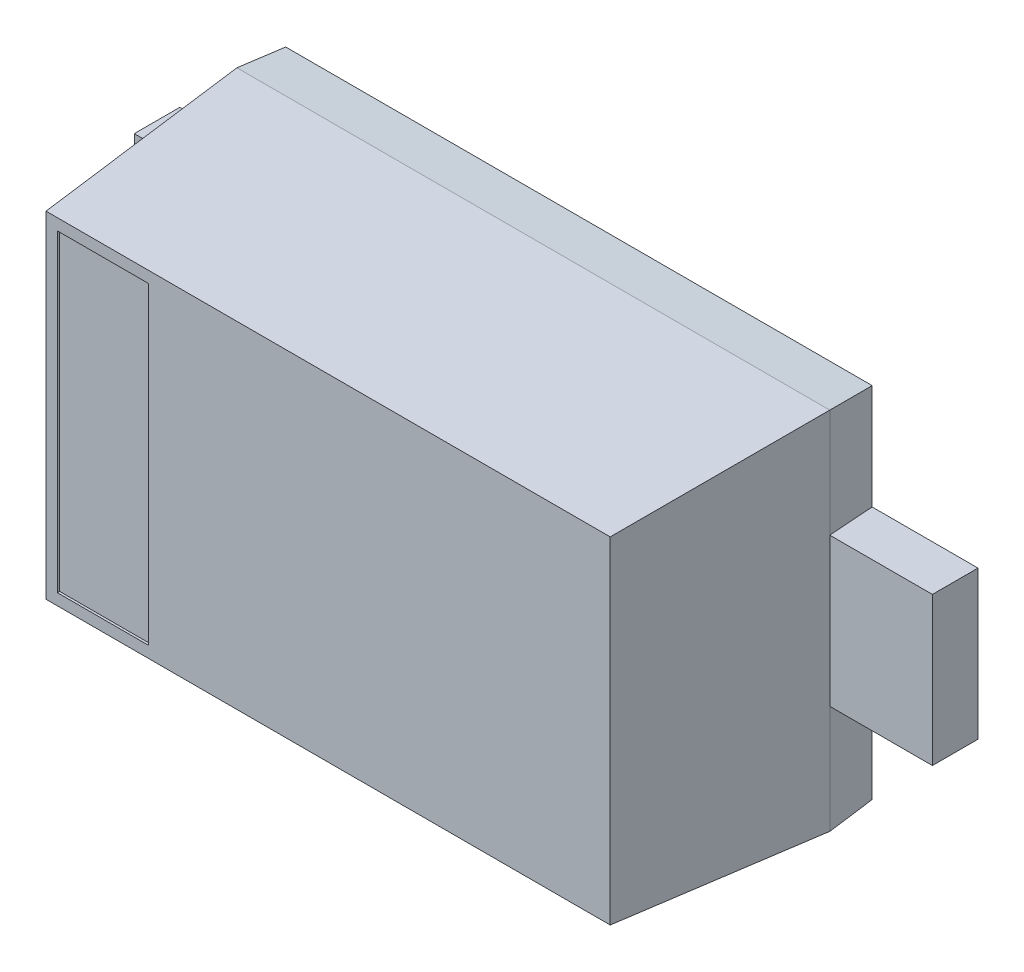
ISO-10303-21;
HEADER;
FILE_DESCRIPTION(('STEP AP214'),'2;1');
FILE_NAME('part.step','',(''),(''),'','','');
FILE_SCHEMA(('AUTOMOTIVE_DESIGN { 1 0 10303 214 1 1 1 1 }'));
ENDSEC;
DATA;
#1=APPLICATION_CONTEXT('core data for automotive mechanical design processes');
#2=APPLICATION_PROTOCOL_DEFINITION('international standard','automotive_design',2000,#1);
#3=PRODUCT_CONTEXT('',#1,'mechanical');
#4=PRODUCT('Part','Part','',(#3));
#5=PRODUCT_RELATED_PRODUCT_CATEGORY('part','',(#4));
#6=PRODUCT_DEFINITION_FORMATION('','',#4);
#7=PRODUCT_DEFINITION_CONTEXT('part definition',#1,'design');
#8=PRODUCT_DEFINITION('design','',#6,#7);
#9=PRODUCT_DEFINITION_SHAPE('','',#8);
#10=(LENGTH_UNIT() NAMED_UNIT(*) SI_UNIT(.MILLI.,.METRE.));
#11=(NAMED_UNIT(*) PLANE_ANGLE_UNIT() SI_UNIT($,.RADIAN.));
#12=(NAMED_UNIT(*) SI_UNIT($,.STERADIAN.) SOLID_ANGLE_UNIT());
#13=UNCERTAINTY_MEASURE_WITH_UNIT(LENGTH_MEASURE(1.E-05),#10,'distance_accuracy_value','');
#14=(GEOMETRIC_REPRESENTATION_CONTEXT(3) GLOBAL_UNCERTAINTY_ASSIGNED_CONTEXT((#13)) GLOBAL_UNIT_ASSIGNED_CONTEXT((#10,
#11,#12)) REPRESENTATION_CONTEXT('',''));
#15=CARTESIAN_POINT('',(0.,0.,0.));
#16=DIRECTION('',(0.,0.,1.));
#17=DIRECTION('',(1.,0.,0.));
#18=AXIS2_PLACEMENT_3D('',#15,#16,#17);
#19=CARTESIAN_POINT('',(1.75,-0.325,0.));
#20=DIRECTION('',(1.,0.,0.));
#21=DIRECTION('',(0.,0.,1.));
#22=AXIS2_PLACEMENT_3D('',#19,#20,#21);
#23=PLANE('',#22);
#24=DIRECTION('',(0.,0.,1.));
#25=VECTOR('',#24,1.);
#26=CARTESIAN_POINT('',(1.75,-0.325,0.));
#27=LINE('',#26,#25);
#28=CARTESIAN_POINT('',(1.75,-0.325,0.));
#29=VERTEX_POINT('',#28);
#30=CARTESIAN_POINT('',(1.75,-0.325,0.2));
#31=VERTEX_POINT('',#30);
#32=EDGE_CURVE('E11',#29,#31,#27,.T.);
#33=ORIENTED_EDGE('',*,*,#32,.F.);
#34=DIRECTION('',(0.,1.,0.));
#35=VECTOR('',#34,1.);
#36=CARTESIAN_POINT('',(1.75,-0.325,0.));
#37=LINE('',#36,#35);
#38=CARTESIAN_POINT('',(1.75,0.325,0.));
#39=VERTEX_POINT('',#38);
#40=EDGE_CURVE('E25',#29,#39,#37,.T.);
#41=ORIENTED_EDGE('',*,*,#40,.T.);
#42=DIRECTION('',(0.,0.,1.));
#43=VECTOR('',#42,1.);
#44=CARTESIAN_POINT('',(1.75,0.325,0.));
#45=LINE('',#44,#43);
#46=CARTESIAN_POINT('',(1.75,0.325,0.2));
#47=VERTEX_POINT('',#46);
#48=EDGE_CURVE('E494',#39,#47,#45,.T.);
#49=ORIENTED_EDGE('',*,*,#48,.T.);
#50=DIRECTION('',(0.,1.,0.));
#51=VECTOR('',#50,1.);
#52=CARTESIAN_POINT('',(1.75,-0.325,0.2));
#53=LINE('',#52,#51);
#54=EDGE_CURVE('E489',#31,#47,#53,.T.);
#55=ORIENTED_EDGE('',*,*,#54,.F.);
#56=EDGE_LOOP('',(#33,#41,#49,#55));
#57=FACE_BOUND('',#56,.T.);
#58=ADVANCED_FACE('F17',(#57),#23,.T.);
#59=CARTESIAN_POINT('',(1.286014637611,-0.325,0.2));
#60=DIRECTION('',(0.,0.,1.));
#61=DIRECTION('',(1.,0.,0.));
#62=AXIS2_PLACEMENT_3D('',#59,#60,#61);
#63=PLANE('',#62);
#64=DIRECTION('',(0.,1.,0.));
#65=VECTOR('',#64,1.);
#66=CARTESIAN_POINT('',(1.3,-0.8,0.2));
#67=LINE('',#66,#65);
#68=CARTESIAN_POINT('',(1.3,-0.325,0.2));
#69=VERTEX_POINT('',#68);
#70=CARTESIAN_POINT('',(1.3,0.325,0.2));
#71=VERTEX_POINT('',#70);
#72=EDGE_CURVE('E485',#69,#71,#67,.T.);
#73=ORIENTED_EDGE('',*,*,#72,.F.);
#74=DIRECTION('',(1.,0.,0.));
#75=VECTOR('',#74,1.);
#76=CARTESIAN_POINT('',(1.286014637611,-0.325,0.2));
#77=LINE('',#76,#75);
#78=EDGE_CURVE('E480',#69,#31,#77,.T.);
#79=ORIENTED_EDGE('',*,*,#78,.T.);
#80=ORIENTED_EDGE('',*,*,#54,.T.);
#81=DIRECTION('',(1.,0.,0.));
#82=VECTOR('',#81,1.);
#83=CARTESIAN_POINT('',(1.286014637611,0.325,0.2));
#84=LINE('',#83,#82);
#85=EDGE_CURVE('E476',#71,#47,#84,.T.);
#86=ORIENTED_EDGE('',*,*,#85,.F.);
#87=EDGE_LOOP('',(#73,#79,#80,#86));
#88=FACE_BOUND('',#87,.T.);
#89=ADVANCED_FACE('F460',(#88),#63,.T.);
#90=CARTESIAN_POINT('',(1.286014637611,0.325,0.));
#91=DIRECTION('',(0.,1.,0.));
#92=DIRECTION('',(0.,0.,1.));
#93=AXIS2_PLACEMENT_3D('',#90,#91,#92);
#94=PLANE('',#93);
#95=DIRECTION('',(1.,0.,0.));
#96=VECTOR('',#95,1.);
#97=CARTESIAN_POINT('',(1.286014637611,0.325,0.));
#98=LINE('',#97,#96);
#99=CARTESIAN_POINT('',(1.286014637611,0.325,0.));
#100=VERTEX_POINT('',#99);
#101=EDGE_CURVE('E474',#100,#39,#98,.T.);
#102=ORIENTED_EDGE('',*,*,#101,.F.);
#103=CARTESIAN_POINT('',(1.3,0.325,0.2));
#104=CARTESIAN_POINT('',(1.3000000002123,0.325001852984815,0.200000003036064));
#105=CARTESIAN_POINT('',(1.29999999108573,0.325003703790327,0.199999872520007));
#106=CARTESIAN_POINT('',(1.29999995532459,0.325007398985879,0.199999361111841));
#107=CARTESIAN_POINT('',(1.29999992842985,0.325009242864676,0.199998976499113));
#108=CARTESIAN_POINT('',(1.29999985724239,0.325012923610334,0.199997958471036));
#109=CARTESIAN_POINT('',(1.29999981241348,0.325014758308439,0.19999731738773));
#110=CARTESIAN_POINT('',(1.29999970569286,0.325018423015654,0.199995791211789));
#111=CARTESIAN_POINT('',(1.2999996430989,0.325020248760763,0.199994896076446));
#112=CARTESIAN_POINT('',(1.29999950098321,0.325023897634918,0.199992863727464));
#113=CARTESIAN_POINT('',(1.29999942069297,0.325025714530678,0.199991715523533));
#114=CARTESIAN_POINT('',(1.2999992432451,0.325029347608087,0.199989177900779));
#115=CARTESIAN_POINT('',(1.29999914533152,0.325031156110907,0.19998777767128));
#116=CARTESIAN_POINT('',(1.29999893262445,0.325034773677275,0.199984735818544));
#117=CARTESIAN_POINT('',(1.29999881713311,0.325036574219608,0.199983084215447));
#118=CARTESIAN_POINT('',(1.29999856922545,0.325040176556294,0.199979538970631));
#119=CARTESIAN_POINT('',(1.29999843618999,0.325041969513657,0.199977636474951));
#120=CARTESIAN_POINT('',(1.29999815313611,0.325045556888106,0.199973588615852));
#121=CARTESIAN_POINT('',(1.29999800258132,0.3250473425378,0.199971435582026));
#122=CARTESIAN_POINT('',(1.29999768443175,0.325050915168858,0.199966885831302));
#123=CARTESIAN_POINT('',(1.2999975163786,0.325052693702191,0.199964482559291));
#124=CARTESIAN_POINT('',(1.29999716318256,0.325056251766673,0.19995943162051));
#125=CARTESIAN_POINT('',(1.29999697765062,0.32505802331221,0.199956778390185));
#126=CARTESIAN_POINT('',(1.2999965894566,0.32506156693552,0.199951226957066));
#127=CARTESIAN_POINT('',(1.29999638646512,0.3250633315567,0.19994832404375));
#128=CARTESIAN_POINT('',(1.29999596332253,0.325066860883474,0.199942272822785));
#129=CARTESIAN_POINT('',(1.29999574289249,0.32506861868485,0.199939120526267));
#130=CARTESIAN_POINT('',(1.29999528484789,0.325072133633681,0.199932570183266));
#131=CARTESIAN_POINT('',(1.29999504699635,0.325073884401301,0.199929168747896));
#132=CARTESIAN_POINT('',(1.29999428684852,0.325079284237493,0.199918298127349));
#133=CARTESIAN_POINT('',(1.29999375823402,0.325082750526308,0.199910738587803));
#134=CARTESIAN_POINT('',(1.29999263300674,0.325089697288936,0.199894647088017));
#135=CARTESIAN_POINT('',(1.29999203523694,0.325093138530401,0.199886098581612));
#136=CARTESIAN_POINT('',(1.29999077145937,0.325100028665718,0.199868025720378));
#137=CARTESIAN_POINT('',(1.29999010457623,0.325103444302083,0.199858488847182));
#138=CARTESIAN_POINT('',(1.29998870255609,0.325110278310796,0.199838439025114));
#139=CARTESIAN_POINT('',(1.29998796675383,0.325113668375677,0.199827916562527));
#140=CARTESIAN_POINT('',(1.29998642689835,0.325120445913506,0.199805895603202));
#141=CARTESIAN_POINT('',(1.29998562232708,0.325123809009315,0.199794389698011));
#142=CARTESIAN_POINT('',(1.29998301159693,0.325134276022294,0.199757054517504));
#143=CARTESIAN_POINT('',(1.29998119553957,0.325140870792971,0.199731083687193));
#144=CARTESIAN_POINT('',(1.29997729327849,0.325154089575486,0.199675278753905));
#145=CARTESIAN_POINT('',(1.29997520504587,0.325160586927596,0.199645415636097));
#146=CARTESIAN_POINT('',(1.29996814881771,0.325181246799908,0.199544506872178));
#147=CARTESIAN_POINT('',(1.29996315691384,0.325193708718368,0.199473119320964));
#148=CARTESIAN_POINT('',(1.29995210997199,0.32521880621367,0.199315140692485));
#149=CARTESIAN_POINT('',(1.29994604971987,0.325230939016061,0.199228475049363));
#150=CARTESIAN_POINT('',(1.29992474394382,0.325270260148679,0.198923788256826));
#151=CARTESIAN_POINT('',(1.29990945528156,0.325292497865534,0.19870515020036));
#152=CARTESIAN_POINT('',(1.29985140379195,0.325368148662417,0.197874975221756));
#153=CARTESIAN_POINT('',(1.29980855339219,0.325405927667173,0.197262185955845));
#154=CARTESIAN_POINT('',(1.29970723880808,0.325482141866091,0.195813319901541));
#155=CARTESIAN_POINT('',(1.29964876100014,0.325515823643959,0.194977048286714));
#156=CARTESIAN_POINT('',(1.2994298506698,0.325624773491611,0.191846484712438));
#157=CARTESIAN_POINT('',(1.29926934896552,0.325670214877224,0.189551203406065));
#158=CARTESIAN_POINT('',(1.29889601880735,0.325752450972714,0.184212333410635));
#159=CARTESIAN_POINT('',(1.29868318702806,0.325781599208683,0.181168697166213));
#160=CARTESIAN_POINT('',(1.29791495911571,0.325856948234193,0.170182526182852));
#161=CARTESIAN_POINT('',(1.29735953823424,0.325855088248179,0.162239637524993));
#162=CARTESIAN_POINT('',(1.29612123741121,0.32581643024737,0.144531110729935));
#163=CARTESIAN_POINT('',(1.29543836198301,0.325771711329798,0.134765537136549));
#164=CARTESIAN_POINT('',(1.29399976688302,0.325655303161042,0.114192668733497));
#165=CARTESIAN_POINT('',(1.29324404778417,0.325581245631952,0.103385382117218));
#166=CARTESIAN_POINT('',(1.29171440077161,0.325426653323768,0.0815104107004548));
#167=CARTESIAN_POINT('',(1.29094047295853,0.325346005455687,0.0704427273389712));
#168=CARTESIAN_POINT('',(1.28942903647389,0.325197298227308,0.0488281786044773));
#169=CARTESIAN_POINT('',(1.288691528085,0.325128825031616,0.0382813172736782));
#170=CARTESIAN_POINT('',(1.28730756022007,0.3250351087005,0.0184896547277039));
#171=CARTESIAN_POINT('',(1.28666110205543,0.325005571834872,0.00924487226648126));
#172=CARTESIAN_POINT('',(1.286014637611,0.325,0.));
#173=B_SPLINE_CURVE_WITH_KNOTS('',3,(#103,#104,#105,#106,#107,#108,#109,#110,#111,#112,#113,
#114,#115,#116,#117,#118,#119,#120,#121,#122,#123,#124,#125,#126,#127,#128,#129,#130,#131,#132,
#133,#134,#135,#136,#137,#138,#139,#140,#141,#142,#143,#144,#145,#146,#147,#148,#149,#150,#151,
#152,#153,#154,#155,#156,#157,#158,#159,#160,#161,#162,#163,#164,#165,#166,#167,#168,#169,#170,
#171,#172),.UNSPECIFIED.,.F.,.F.,(4,2,2,2,2,2,2,2,2,2,2,2,2,2,2,2,2,2,2,2,2,2,2,2,2,2,2,2,2,2,2,
2,2,2,4),(0.,5.55082990050948E-06,1.11847948740757E-05,1.70015646702176E-05,
2.30914194652532E-05,2.95327703153316E-05,3.63916116312509E-05,4.37223233649085E-05,
5.15691566190954E-05,5.99679056265568E-05,6.89474840274619E-05,7.85312852153188E-05,
8.87383007563731E-05,9.9584015551984E-05,0.000111081114330076,0.000136067197094094,
0.000163763098159516,0.000194212685221291,0.000227446512666191,0.000263485837393122,
0.000344030437129394,0.0004359173877425,0.000653752897419189,0.000916887016429347,
0.00157760290760092,0.00342353448293213,0.00594047018979153,0.0128439169230765,
0.0219975858685628,0.0458839227674527,0.0752525882281046,0.107754322853686,0.141039356158064,
0.17275781927643,0.200560030702982),.UNSPECIFIED.);
#174=EDGE_CURVE('E426',#100,#71,#173,.F.);
#175=ORIENTED_EDGE('',*,*,#174,.T.);
#176=ORIENTED_EDGE('',*,*,#85,.T.);
#177=ORIENTED_EDGE('',*,*,#48,.F.);
#178=EDGE_LOOP('',(#102,#175,#176,#177));
#179=FACE_BOUND('',#178,.T.);
#180=ADVANCED_FACE('F448',(#179),#94,.T.);
#181=CARTESIAN_POINT('',(1.286014637611,0.316984965574061,0.));
#182=CARTESIAN_POINT('',(1.3,0.322625,0.2));
#183=CARTESIAN_POINT('',(1.286014637611,0.786014637611,0.));
#184=CARTESIAN_POINT('',(1.3,0.8,0.2));
#185=B_SPLINE_SURFACE_WITH_KNOTS('',1,1,((#181,#182),(#183,#184)),.UNSPECIFIED.,.F.,.F.,.F.,(2,
2),(2,2),(1.122625,1.6),(0.,1.),.UNSPECIFIED.);
#186=DIRECTION('',(0.,1.,0.));
#187=VECTOR('',#186,1.);
#188=CARTESIAN_POINT('',(1.286014637611,-0.786014637611,0.));
#189=LINE('',#188,#187);
#190=CARTESIAN_POINT('',(1.286014637611,0.786014637611,0.));
#191=VERTEX_POINT('',#190);
#192=EDGE_CURVE('E422',#100,#191,#189,.T.);
#193=DIRECTION('',(0.0695873743181329,0.0695873743181329,0.995145815783303));
#194=VECTOR('',#193,1.);
#195=CARTESIAN_POINT('',(1.286014637611,0.786014637611,0.));
#196=LINE('',#195,#194);
#197=CARTESIAN_POINT('',(1.3,0.8,0.2));
#198=VERTEX_POINT('',#197);
#199=EDGE_CURVE('E418',#191,#198,#196,.T.);
#200=DIRECTION('',(0.,1.,0.));
#201=VECTOR('',#200,1.);
#202=CARTESIAN_POINT('',(1.3,-0.8,0.2));
#203=LINE('',#202,#201);
#204=EDGE_CURVE('E413',#71,#198,#203,.T.);
#205=ORIENTED_EDGE('',*,*,#174,.F.);
#206=ORIENTED_EDGE('',*,*,#192,.T.);
#207=ORIENTED_EDGE('',*,*,#199,.T.);
#208=ORIENTED_EDGE('',*,*,#204,.F.);
#209=EDGE_LOOP('',(#205,#206,#207,#208));
#210=FACE_BOUND('',#209,.T.);
#211=ADVANCED_FACE('F435',(#210),#185,.T.);
#212=CARTESIAN_POINT('',(1.3,-0.8,0.2));
#213=CARTESIAN_POINT('',(1.237065869251,-0.737065869251,1.1));
#214=CARTESIAN_POINT('',(1.3,0.8,0.2));
#215=CARTESIAN_POINT('',(1.237065869251,0.737065869251,1.1));
#216=B_SPLINE_SURFACE_WITH_KNOTS('',1,1,((#212,#213),(#214,#215)),.UNSPECIFIED.,.F.,.F.,.F.,(2,
2),(2,2),(0.,1.6),(0.,1.),.UNSPECIFIED.);
#217=DIRECTION('',(0.,1.,0.));
#218=VECTOR('',#217,1.);
#219=CARTESIAN_POINT('',(1.3,-0.8,0.2));
#220=LINE('',#219,#218);
#221=CARTESIAN_POINT('',(1.3,-0.8,0.2));
#222=VERTEX_POINT('',#221);
#223=EDGE_CURVE('E408',#222,#69,#220,.T.);
#224=DIRECTION('',(-0.0695873743164903,-0.0695873743164901,0.995145815783533));
#225=VECTOR('',#224,1.);
#226=CARTESIAN_POINT('',(1.3,0.8,0.2));
#227=LINE('',#226,#225);
#228=CARTESIAN_POINT('',(1.237065869251,0.737065869251,1.1));
#229=VERTEX_POINT('',#228);
#230=EDGE_CURVE('E404',#198,#229,#227,.T.);
#231=DIRECTION('',(0.,1.,0.));
#232=VECTOR('',#231,1.);
#233=CARTESIAN_POINT('',(1.237065869251,-0.737065869251,1.1));
#234=LINE('',#233,#232);
#235=CARTESIAN_POINT('',(1.237065869251,-0.737065869251,1.1));
#236=VERTEX_POINT('',#235);
#237=EDGE_CURVE('E399',#236,#229,#234,.T.);
#238=DIRECTION('',(-0.0695873743164903,0.0695873743164901,0.995145815783533));
#239=VECTOR('',#238,1.);
#240=CARTESIAN_POINT('',(1.3,-0.8,0.2));
#241=LINE('',#240,#239);
#242=EDGE_CURVE('E394',#222,#236,#241,.T.);
#243=ORIENTED_EDGE('',*,*,#223,.T.);
#244=ORIENTED_EDGE('',*,*,#72,.T.);
#245=ORIENTED_EDGE('',*,*,#204,.T.);
#246=ORIENTED_EDGE('',*,*,#230,.T.);
#247=ORIENTED_EDGE('',*,*,#237,.F.);
#248=ORIENTED_EDGE('',*,*,#242,.F.);
#249=EDGE_LOOP('',(#243,#244,#245,#246,#247,#248));
#250=FACE_BOUND('',#249,.T.);
#251=ADVANCED_FACE('F447',(#250),#216,.T.);
#252=CARTESIAN_POINT('',(-1.3,-0.8,0.2));
#253=CARTESIAN_POINT('',(-1.237065869251,-0.737065869251,1.1));
#254=CARTESIAN_POINT('',(1.3,-0.8,0.2));
#255=CARTESIAN_POINT('',(1.237065869251,-0.737065869251,1.1));
#256=B_SPLINE_SURFACE_WITH_KNOTS('',1,1,((#252,#253),(#254,#255)),.UNSPECIFIED.,.F.,.F.,.F.,(2,
2),(2,2),(0.,2.6),(0.,1.),.UNSPECIFIED.);
#257=DIRECTION('',(1.,0.,0.));
#258=VECTOR('',#257,1.);
#259=CARTESIAN_POINT('',(-1.3,-0.8,0.2));
#260=LINE('',#259,#258);
#261=CARTESIAN_POINT('',(-1.3,-0.8,0.2));
#262=VERTEX_POINT('',#261);
#263=EDGE_CURVE('E389',#262,#222,#260,.T.);
#264=DIRECTION('',(1.,0.,0.));
#265=VECTOR('',#264,1.);
#266=CARTESIAN_POINT('',(-1.237065869251,-0.737065869251,1.1));
#267=LINE('',#266,#265);
#268=CARTESIAN_POINT('',(-1.237065869251,-0.737065869251,1.1));
#269=VERTEX_POINT('',#268);
#270=EDGE_CURVE('E384',#269,#236,#267,.T.);
#271=DIRECTION('',(0.0695873743164903,0.0695873743164901,0.995145815783533));
#272=VECTOR('',#271,1.);
#273=CARTESIAN_POINT('',(-1.3,-0.8,0.2));
#274=LINE('',#273,#272);
#275=EDGE_CURVE('E379',#262,#269,#274,.T.);
#276=ORIENTED_EDGE('',*,*,#263,.T.);
#277=ORIENTED_EDGE('',*,*,#242,.T.);
#278=ORIENTED_EDGE('',*,*,#270,.F.);
#279=ORIENTED_EDGE('',*,*,#275,.F.);
#280=EDGE_LOOP('',(#276,#277,#278,#279));
#281=FACE_BOUND('',#280,.T.);
#282=ADVANCED_FACE('F551',(#281),#256,.T.);
#283=CARTESIAN_POINT('',(-1.3,0.8,0.2));
#284=CARTESIAN_POINT('',(-1.237065869251,0.737065869251,1.1));
#285=CARTESIAN_POINT('',(-1.3,-0.8,0.2));
#286=CARTESIAN_POINT('',(-1.237065869251,-0.737065869251,1.1));
#287=B_SPLINE_SURFACE_WITH_KNOTS('',1,1,((#283,#284),(#285,#286)),.UNSPECIFIED.,.F.,.F.,.F.,(2,
2),(2,2),(0.,1.6),(0.,1.),.UNSPECIFIED.);
#288=DIRECTION('',(0.,-1.,0.));
#289=VECTOR('',#288,1.);
#290=CARTESIAN_POINT('',(-1.3,0.8,0.2));
#291=LINE('',#290,#289);
#292=CARTESIAN_POINT('',(-1.3,0.8,0.2));
#293=VERTEX_POINT('',#292);
#294=CARTESIAN_POINT('',(-1.3,0.325,0.2));
#295=VERTEX_POINT('',#294);
#296=EDGE_CURVE('E375',#293,#295,#291,.T.);
#297=DIRECTION('',(0.,-1.,0.));
#298=VECTOR('',#297,1.);
#299=CARTESIAN_POINT('',(-1.3,0.8,0.2));
#300=LINE('',#299,#298);
#301=CARTESIAN_POINT('',(-1.3,-0.325,0.2));
#302=VERTEX_POINT('',#301);
#303=EDGE_CURVE('E371',#295,#302,#300,.T.);
#304=DIRECTION('',(0.,-1.,0.));
#305=VECTOR('',#304,1.);
#306=CARTESIAN_POINT('',(-1.3,0.8,0.2));
#307=LINE('',#306,#305);
#308=EDGE_CURVE('E366',#302,#262,#307,.T.);
#309=DIRECTION('',(0.,-1.,0.));
#310=VECTOR('',#309,1.);
#311=CARTESIAN_POINT('',(-1.237065869251,0.737065869251,1.1));
#312=LINE('',#311,#310);
#313=CARTESIAN_POINT('',(-1.237065869251,0.737065869251,1.1));
#314=VERTEX_POINT('',#313);
#315=EDGE_CURVE('E361',#314,#269,#312,.T.);
#316=DIRECTION('',(0.0695873743164903,-0.0695873743164901,0.995145815783533));
#317=VECTOR('',#316,1.);
#318=CARTESIAN_POINT('',(-1.3,0.8,0.2));
#319=LINE('',#318,#317);
#320=EDGE_CURVE('E356',#293,#314,#319,.T.);
#321=ORIENTED_EDGE('',*,*,#296,.T.);
#322=ORIENTED_EDGE('',*,*,#303,.T.);
#323=ORIENTED_EDGE('',*,*,#308,.T.);
#324=ORIENTED_EDGE('',*,*,#275,.T.);
#325=ORIENTED_EDGE('',*,*,#315,.F.);
#326=ORIENTED_EDGE('',*,*,#320,.F.);
#327=EDGE_LOOP('',(#321,#322,#323,#324,#325,#326));
#328=FACE_BOUND('',#327,.T.);
#329=ADVANCED_FACE('F532',(#328),#287,.T.);
#330=CARTESIAN_POINT('',(1.3,0.8,0.2));
#331=CARTESIAN_POINT('',(1.237065869251,0.737065869251,1.1));
#332=CARTESIAN_POINT('',(-1.3,0.8,0.2));
#333=CARTESIAN_POINT('',(-1.237065869251,0.737065869251,1.1));
#334=B_SPLINE_SURFACE_WITH_KNOTS('',1,1,((#330,#331),(#332,#333)),.UNSPECIFIED.,.F.,.F.,.F.,(2,
2),(2,2),(0.,2.6),(0.,1.),.UNSPECIFIED.);
#335=DIRECTION('',(-1.,0.,0.));
#336=VECTOR('',#335,1.);
#337=CARTESIAN_POINT('',(1.3,0.8,0.2));
#338=LINE('',#337,#336);
#339=EDGE_CURVE('E351',#198,#293,#338,.T.);
#340=DIRECTION('',(-1.,0.,0.));
#341=VECTOR('',#340,1.);
#342=CARTESIAN_POINT('',(1.237065869251,0.737065869251,1.1));
#343=LINE('',#342,#341);
#344=EDGE_CURVE('E346',#229,#314,#343,.T.);
#345=ORIENTED_EDGE('',*,*,#339,.T.);
#346=ORIENTED_EDGE('',*,*,#320,.T.);
#347=ORIENTED_EDGE('',*,*,#344,.F.);
#348=ORIENTED_EDGE('',*,*,#230,.F.);
#349=EDGE_LOOP('',(#345,#346,#347,#348));
#350=FACE_BOUND('',#349,.T.);
#351=ADVANCED_FACE('F546',(#350),#334,.T.);
#352=CARTESIAN_POINT('',(-1.237065869251,-0.737065869251,1.1));
#353=DIRECTION('',(0.,0.,-1.));
#354=DIRECTION('',(0.859073922076259,0.511851537468154,0.));
#355=AXIS2_PLACEMENT_3D('',#352,#353,#354);
#356=PLANE('',#355);
#357=ORIENTED_EDGE('',*,*,#237,.T.);
#358=ORIENTED_EDGE('',*,*,#344,.T.);
#359=ORIENTED_EDGE('',*,*,#315,.T.);
#360=ORIENTED_EDGE('',*,*,#270,.T.);
#361=EDGE_LOOP('',(#357,#358,#359,#360));
#362=FACE_BOUND('',#361,.T.);
#363=DIRECTION('',(1.,0.,0.));
#364=VECTOR('',#363,1.);
#365=CARTESIAN_POINT('',(-1.212065869251,-0.687065869251,1.1));
#366=LINE('',#365,#364);
#367=CARTESIAN_POINT('',(-1.187065869251,-0.687065869251,1.1));
#368=VERTEX_POINT('',#367);
#369=CARTESIAN_POINT('',(-0.787065869251,-0.687065869251,1.1));
#370=VERTEX_POINT('',#369);
#371=EDGE_CURVE('E341',#368,#370,#366,.T.);
#372=ORIENTED_EDGE('',*,*,#371,.F.);
#373=DIRECTION('',(0.,-1.,0.));
#374=VECTOR('',#373,1.);
#375=CARTESIAN_POINT('',(-1.187065869251,-0.712065869251,1.1));
#376=LINE('',#375,#374);
#377=CARTESIAN_POINT('',(-1.187065869251,0.687065869251,1.1));
#378=VERTEX_POINT('',#377);
#379=EDGE_CURVE('E336',#378,#368,#376,.T.);
#380=ORIENTED_EDGE('',*,*,#379,.F.);
#381=DIRECTION('',(1.,0.,0.));
#382=VECTOR('',#381,1.);
#383=CARTESIAN_POINT('',(-1.212065869251,0.687065869251,1.1));
#384=LINE('',#383,#382);
#385=CARTESIAN_POINT('',(-0.787065869251,0.687065869251,1.1));
#386=VERTEX_POINT('',#385);
#387=EDGE_CURVE('E332',#378,#386,#384,.T.);
#388=ORIENTED_EDGE('',*,*,#387,.T.);
#389=DIRECTION('',(0.,-1.,0.));
#390=VECTOR('',#389,1.);
#391=CARTESIAN_POINT('',(-0.787065869251,-0.712065869251,1.1));
#392=LINE('',#391,#390);
#393=EDGE_CURVE('E328',#386,#370,#392,.T.);
#394=ORIENTED_EDGE('',*,*,#393,.T.);
#395=EDGE_LOOP('',(#372,#380,#388,#394));
#396=FACE_BOUND('',#395,.T.);
#397=ADVANCED_FACE('F548',(#362,#396),#356,.F.);
#398=CARTESIAN_POINT('',(-0.787065869251,-0.687065869251,1.09));
#399=DIRECTION('',(1.,0.,0.));
#400=DIRECTION('',(0.,0.,1.));
#401=AXIS2_PLACEMENT_3D('',#398,#399,#400);
#402=PLANE('',#401);
#403=ORIENTED_EDGE('',*,*,#393,.F.);
#404=DIRECTION('',(0.,0.,1.));
#405=VECTOR('',#404,1.);
#406=CARTESIAN_POINT('',(-0.787065869251,0.687065869251,1.09));
#407=LINE('',#406,#405);
#408=CARTESIAN_POINT('',(-0.787065869251,0.687065869251,1.09));
#409=VERTEX_POINT('',#408);
#410=EDGE_CURVE('E323',#409,#386,#407,.T.);
#411=ORIENTED_EDGE('',*,*,#410,.F.);
#412=DIRECTION('',(0.,1.,0.));
#413=VECTOR('',#412,1.);
#414=CARTESIAN_POINT('',(-0.787065869251,-0.687065869251,1.09));
#415=LINE('',#414,#413);
#416=CARTESIAN_POINT('',(-0.787065869251,-0.687065869251,1.09));
#417=VERTEX_POINT('',#416);
#418=EDGE_CURVE('E318',#417,#409,#415,.T.);
#419=ORIENTED_EDGE('',*,*,#418,.F.);
#420=DIRECTION('',(0.,0.,1.));
#421=VECTOR('',#420,1.);
#422=CARTESIAN_POINT('',(-0.787065869251,-0.687065869251,1.09));
#423=LINE('',#422,#421);
#424=EDGE_CURVE('E313',#417,#370,#423,.T.);
#425=ORIENTED_EDGE('',*,*,#424,.T.);
#426=EDGE_LOOP('',(#403,#411,#419,#425));
#427=FACE_BOUND('',#426,.T.);
#428=ADVANCED_FACE('F579',(#427),#402,.F.);
#429=CARTESIAN_POINT('',(-1.187065869251,-0.687065869251,1.09));
#430=DIRECTION('',(0.,1.,0.));
#431=DIRECTION('',(0.,0.,1.));
#432=AXIS2_PLACEMENT_3D('',#429,#430,#431);
#433=PLANE('',#432);
#434=ORIENTED_EDGE('',*,*,#424,.F.);
#435=DIRECTION('',(1.,0.,0.));
#436=VECTOR('',#435,1.);
#437=CARTESIAN_POINT('',(-1.187065869251,-0.687065869251,1.09));
#438=LINE('',#437,#436);
#439=CARTESIAN_POINT('',(-1.187065869251,-0.687065869251,1.09));
#440=VERTEX_POINT('',#439);
#441=EDGE_CURVE('E308',#440,#417,#438,.T.);
#442=ORIENTED_EDGE('',*,*,#441,.F.);
#443=DIRECTION('',(0.,0.,1.));
#444=VECTOR('',#443,1.);
#445=CARTESIAN_POINT('',(-1.187065869251,-0.687065869251,1.09));
#446=LINE('',#445,#444);
#447=EDGE_CURVE('E303',#440,#368,#446,.T.);
#448=ORIENTED_EDGE('',*,*,#447,.T.);
#449=ORIENTED_EDGE('',*,*,#371,.T.);
#450=EDGE_LOOP('',(#434,#442,#448,#449));
#451=FACE_BOUND('',#450,.T.);
#452=ADVANCED_FACE('F582',(#451),#433,.T.);
#453=CARTESIAN_POINT('',(-1.187065869251,-0.687065869251,1.09));
#454=DIRECTION('',(1.,0.,0.));
#455=DIRECTION('',(0.,0.,1.));
#456=AXIS2_PLACEMENT_3D('',#453,#454,#455);
#457=PLANE('',#456);
#458=ORIENTED_EDGE('',*,*,#447,.F.);
#459=DIRECTION('',(0.,1.,0.));
#460=VECTOR('',#459,1.);
#461=CARTESIAN_POINT('',(-1.187065869251,-0.687065869251,1.09));
#462=LINE('',#461,#460);
#463=CARTESIAN_POINT('',(-1.187065869251,0.687065869251,1.09));
#464=VERTEX_POINT('',#463);
#465=EDGE_CURVE('E299',#440,#464,#462,.T.);
#466=ORIENTED_EDGE('',*,*,#465,.T.);
#467=DIRECTION('',(0.,0.,1.));
#468=VECTOR('',#467,1.);
#469=CARTESIAN_POINT('',(-1.187065869251,0.687065869251,1.09));
#470=LINE('',#469,#468);
#471=EDGE_CURVE('E294',#464,#378,#470,.T.);
#472=ORIENTED_EDGE('',*,*,#471,.T.);
#473=ORIENTED_EDGE('',*,*,#379,.T.);
#474=EDGE_LOOP('',(#458,#466,#472,#473));
#475=FACE_BOUND('',#474,.T.);
#476=ADVANCED_FACE('F590',(#475),#457,.T.);
#477=CARTESIAN_POINT('',(-1.187065869251,0.687065869251,1.09));
#478=DIRECTION('',(0.,1.,0.));
#479=DIRECTION('',(0.,0.,1.));
#480=AXIS2_PLACEMENT_3D('',#477,#478,#479);
#481=PLANE('',#480);
#482=ORIENTED_EDGE('',*,*,#387,.F.);
#483=ORIENTED_EDGE('',*,*,#471,.F.);
#484=DIRECTION('',(1.,0.,0.));
#485=VECTOR('',#484,1.);
#486=CARTESIAN_POINT('',(-1.187065869251,0.687065869251,1.09));
#487=LINE('',#486,#485);
#488=EDGE_CURVE('E289',#464,#409,#487,.T.);
#489=ORIENTED_EDGE('',*,*,#488,.T.);
#490=ORIENTED_EDGE('',*,*,#410,.T.);
#491=EDGE_LOOP('',(#482,#483,#489,#490));
#492=FACE_BOUND('',#491,.T.);
#493=ADVANCED_FACE('F598',(#492),#481,.F.);
#494=CARTESIAN_POINT('',(-1.187065869251,-0.687065869251,1.09));
#495=DIRECTION('',(0.,0.,1.));
#496=DIRECTION('',(1.,0.,0.));
#497=AXIS2_PLACEMENT_3D('',#494,#495,#496);
#498=PLANE('',#497);
#499=ORIENTED_EDGE('',*,*,#465,.F.);
#500=ORIENTED_EDGE('',*,*,#441,.T.);
#501=ORIENTED_EDGE('',*,*,#418,.T.);
#502=ORIENTED_EDGE('',*,*,#488,.F.);
#503=EDGE_LOOP('',(#499,#500,#501,#502));
#504=FACE_BOUND('',#503,.T.);
#505=ADVANCED_FACE('F606',(#504),#498,.T.);
#506=CARTESIAN_POINT('',(1.286014637611,0.786014637611,0.));
#507=CARTESIAN_POINT('',(1.3,0.8,0.2));
#508=CARTESIAN_POINT('',(-1.286014637611,0.786014637611,0.));
#509=CARTESIAN_POINT('',(-1.3,0.8,0.2));
#510=B_SPLINE_SURFACE_WITH_KNOTS('',1,1,((#506,#507),(#508,#509)),.UNSPECIFIED.,.F.,.F.,.F.,(2,
2),(2,2),(0.,2.6),(0.,1.),.UNSPECIFIED.);
#511=DIRECTION('',(-1.,0.,0.));
#512=VECTOR('',#511,1.);
#513=CARTESIAN_POINT('',(1.286014637611,0.786014637611,0.));
#514=LINE('',#513,#512);
#515=CARTESIAN_POINT('',(-1.286014637611,0.786014637611,0.));
#516=VERTEX_POINT('',#515);
#517=EDGE_CURVE('E285',#191,#516,#514,.T.);
#518=DIRECTION('',(-0.0695873743181329,0.0695873743181329,0.995145815783303));
#519=VECTOR('',#518,1.);
#520=CARTESIAN_POINT('',(-1.286014637611,0.786014637611,0.));
#521=LINE('',#520,#519);
#522=EDGE_CURVE('E280',#516,#293,#521,.T.);
#523=ORIENTED_EDGE('',*,*,#517,.T.);
#524=ORIENTED_EDGE('',*,*,#522,.T.);
#525=ORIENTED_EDGE('',*,*,#339,.F.);
#526=ORIENTED_EDGE('',*,*,#199,.F.);
#527=EDGE_LOOP('',(#523,#524,#525,#526));
#528=FACE_BOUND('',#527,.T.);
#529=ADVANCED_FACE('F544',(#528),#510,.T.);
#530=CARTESIAN_POINT('',(-1.286014637611,0.786014637611,0.));
#531=CARTESIAN_POINT('',(-1.3,0.8,0.2));
#532=CARTESIAN_POINT('',(-1.286014637611,0.316984965574061,0.));
#533=CARTESIAN_POINT('',(-1.3,0.322625,0.2));
#534=B_SPLINE_SURFACE_WITH_KNOTS('',1,1,((#530,#531),(#532,#533)),.UNSPECIFIED.,.F.,.F.,.F.,(2,
2),(2,2),(0.,0.477375),(0.,1.),.UNSPECIFIED.);
#535=DIRECTION('',(0.,-1.,0.));
#536=VECTOR('',#535,1.);
#537=CARTESIAN_POINT('',(-1.286014637611,0.786014637611,0.));
#538=LINE('',#537,#536);
#539=CARTESIAN_POINT('',(-1.286014637611,0.325,0.));
#540=VERTEX_POINT('',#539);
#541=EDGE_CURVE('E276',#516,#540,#538,.T.);
#542=DIRECTION('',(-0.0697564737456043,0.,0.997564050259721));
#543=VECTOR('',#542,1.);
#544=CARTESIAN_POINT('',(-1.286014637611,0.325,0.));
#545=LINE('',#544,#543);
#546=EDGE_CURVE('E271',#540,#295,#545,.T.);
#547=ORIENTED_EDGE('',*,*,#522,.F.);
#548=ORIENTED_EDGE('',*,*,#541,.T.);
#549=ORIENTED_EDGE('',*,*,#546,.T.);
#550=ORIENTED_EDGE('',*,*,#296,.F.);
#551=EDGE_LOOP('',(#547,#548,#549,#550));
#552=FACE_BOUND('',#551,.T.);
#553=ADVANCED_FACE('F542',(#552),#534,.T.);
#554=CARTESIAN_POINT('',(-1.286014637611,0.325,0.));
#555=DIRECTION('',(0.,-1.,0.));
#556=DIRECTION('',(0.,0.,1.));
#557=AXIS2_PLACEMENT_3D('',#554,#555,#556);
#558=PLANE('',#557);
#559=DIRECTION('',(0.,0.,1.));
#560=VECTOR('',#559,1.);
#561=CARTESIAN_POINT('',(-1.75,0.325,0.));
#562=LINE('',#561,#560);
#563=CARTESIAN_POINT('',(-1.75,0.325,0.));
#564=VERTEX_POINT('',#563);
#565=CARTESIAN_POINT('',(-1.75,0.325,0.2));
#566=VERTEX_POINT('',#565);
#567=EDGE_CURVE('E267',#564,#566,#562,.T.);
#568=ORIENTED_EDGE('',*,*,#567,.T.);
#569=DIRECTION('',(-1.,0.,0.));
#570=VECTOR('',#569,1.);
#571=CARTESIAN_POINT('',(-1.286014637611,0.325,0.2));
#572=LINE('',#571,#570);
#573=EDGE_CURVE('E158',#295,#566,#572,.T.);
#574=ORIENTED_EDGE('',*,*,#573,.F.);
#575=ORIENTED_EDGE('',*,*,#546,.F.);
#576=DIRECTION('',(-1.,0.,0.));
#577=VECTOR('',#576,1.);
#578=CARTESIAN_POINT('',(-1.286014637611,0.325,0.));
#579=LINE('',#578,#577);
#580=EDGE_CURVE('E260',#540,#564,#579,.T.);
#581=ORIENTED_EDGE('',*,*,#580,.T.);
#582=EDGE_LOOP('',(#568,#574,#575,#581));
#583=FACE_BOUND('',#582,.T.);
#584=ADVANCED_FACE('F536',(#583),#558,.F.);
#585=CARTESIAN_POINT('',(-1.286014637611,0.325,0.));
#586=DIRECTION('',(0.,0.,1.));
#587=DIRECTION('',(-1.,0.,0.));
#588=AXIS2_PLACEMENT_3D('',#585,#586,#587);
#589=PLANE('',#588);
#590=DIRECTION('',(-1.,0.,0.));
#591=VECTOR('',#590,1.);
#592=CARTESIAN_POINT('',(-1.286014637611,-0.325,0.));
#593=LINE('',#592,#591);
#594=CARTESIAN_POINT('',(-1.286014637611,-0.325,0.));
#595=VERTEX_POINT('',#594);
#596=CARTESIAN_POINT('',(-1.75,-0.325,0.));
#597=VERTEX_POINT('',#596);
#598=EDGE_CURVE('E256',#595,#597,#593,.T.);
#599=ORIENTED_EDGE('',*,*,#598,.T.);
#600=DIRECTION('',(0.,-1.,0.));
#601=VECTOR('',#600,1.);
#602=CARTESIAN_POINT('',(-1.75,0.325,0.));
#603=LINE('',#602,#601);
#604=EDGE_CURVE('E164',#564,#597,#603,.T.);
#605=ORIENTED_EDGE('',*,*,#604,.F.);
#606=ORIENTED_EDGE('',*,*,#580,.F.);
#607=DIRECTION('',(0.,-1.,0.));
#608=VECTOR('',#607,1.);
#609=CARTESIAN_POINT('',(-1.286014637611,0.325,0.));
#610=LINE('',#609,#608);
#611=EDGE_CURVE('E249',#540,#595,#610,.T.);
#612=ORIENTED_EDGE('',*,*,#611,.T.);
#613=EDGE_LOOP('',(#599,#605,#606,#612));
#614=FACE_BOUND('',#613,.T.);
#615=ADVANCED_FACE('F539',(#614),#589,.F.);
#616=CARTESIAN_POINT('',(-1.286014637611,-0.786014637611,0.));
#617=DIRECTION('',(0.,0.,-1.));
#618=DIRECTION('',(0.853247349970135,0.521506433104082,0.));
#619=AXIS2_PLACEMENT_3D('',#616,#617,#618);
#620=PLANE('',#619);
#621=DIRECTION('',(1.,0.,0.));
#622=VECTOR('',#621,1.);
#623=CARTESIAN_POINT('',(-1.286014637611,-0.786014637611,0.));
#624=LINE('',#623,#622);
#625=CARTESIAN_POINT('',(-1.286014637611,-0.786014637611,0.));
#626=VERTEX_POINT('',#625);
#627=CARTESIAN_POINT('',(1.286014637611,-0.786014637611,0.));
#628=VERTEX_POINT('',#627);
#629=EDGE_CURVE('E244',#626,#628,#624,.T.);
#630=ORIENTED_EDGE('',*,*,#629,.F.);
#631=DIRECTION('',(0.,-1.,0.));
#632=VECTOR('',#631,1.);
#633=CARTESIAN_POINT('',(-1.286014637611,0.786014637611,0.));
#634=LINE('',#633,#632);
#635=EDGE_CURVE('E240',#595,#626,#634,.T.);
#636=ORIENTED_EDGE('',*,*,#635,.F.);
#637=ORIENTED_EDGE('',*,*,#611,.F.);
#638=ORIENTED_EDGE('',*,*,#541,.F.);
#639=ORIENTED_EDGE('',*,*,#517,.F.);
#640=ORIENTED_EDGE('',*,*,#192,.F.);
#641=DIRECTION('',(0.,1.,0.));
#642=VECTOR('',#641,1.);
#643=CARTESIAN_POINT('',(1.286014637611,-0.325,0.));
#644=LINE('',#643,#642);
#645=CARTESIAN_POINT('',(1.286014637611,-0.325,0.));
#646=VERTEX_POINT('',#645);
#647=EDGE_CURVE('E235',#646,#100,#644,.T.);
#648=ORIENTED_EDGE('',*,*,#647,.F.);
#649=DIRECTION('',(0.,1.,0.));
#650=VECTOR('',#649,1.);
#651=CARTESIAN_POINT('',(1.286014637611,-0.786014637611,0.));
#652=LINE('',#651,#650);
#653=EDGE_CURVE('E230',#628,#646,#652,.T.);
#654=ORIENTED_EDGE('',*,*,#653,.F.);
#655=EDGE_LOOP('',(#630,#636,#637,#638,#639,#640,#648,#654));
#656=FACE_BOUND('',#655,.T.);
#657=ADVANCED_FACE('F515',(#656),#620,.T.);
#658=CARTESIAN_POINT('',(1.286014637611,-0.786014637611,0.));
#659=CARTESIAN_POINT('',(1.3,-0.8,0.2));
#660=CARTESIAN_POINT('',(1.286014637611,-0.316984965574061,0.));
#661=CARTESIAN_POINT('',(1.3,-0.322625,0.2));
#662=B_SPLINE_SURFACE_WITH_KNOTS('',1,1,((#658,#659),(#660,#661)),.UNSPECIFIED.,.F.,.F.,.F.,(2,
2),(2,2),(0.,0.477375),(0.,1.),.UNSPECIFIED.);
#663=DIRECTION('',(0.0695873743181329,-0.0695873743181329,0.995145815783303));
#664=VECTOR('',#663,1.);
#665=CARTESIAN_POINT('',(1.286014637611,-0.786014637611,0.));
#666=LINE('',#665,#664);
#667=EDGE_CURVE('E225',#628,#222,#666,.T.);
#668=DIRECTION('',(0.0697564737456043,0.,0.997564050259721));
#669=VECTOR('',#668,1.);
#670=CARTESIAN_POINT('',(1.286014637611,-0.325,0.));
#671=LINE('',#670,#669);
#672=EDGE_CURVE('E220',#646,#69,#671,.T.);
#673=ORIENTED_EDGE('',*,*,#667,.F.);
#674=ORIENTED_EDGE('',*,*,#653,.T.);
#675=ORIENTED_EDGE('',*,*,#672,.T.);
#676=ORIENTED_EDGE('',*,*,#223,.F.);
#677=EDGE_LOOP('',(#673,#674,#675,#676));
#678=FACE_BOUND('',#677,.T.);
#679=ADVANCED_FACE('F525',(#678),#662,.T.);
#680=CARTESIAN_POINT('',(1.286014637611,-0.325,0.));
#681=DIRECTION('',(0.,1.,0.));
#682=DIRECTION('',(0.,0.,1.));
#683=AXIS2_PLACEMENT_3D('',#680,#681,#682);
#684=PLANE('',#683);
#685=ORIENTED_EDGE('',*,*,#32,.T.);
#686=ORIENTED_EDGE('',*,*,#78,.F.);
#687=ORIENTED_EDGE('',*,*,#672,.F.);
#688=DIRECTION('',(1.,0.,0.));
#689=VECTOR('',#688,1.);
#690=CARTESIAN_POINT('',(1.286014637611,-0.325,0.));
#691=LINE('',#690,#689);
#692=EDGE_CURVE('E216',#646,#29,#691,.T.);
#693=ORIENTED_EDGE('',*,*,#692,.T.);
#694=EDGE_LOOP('',(#685,#686,#687,#693));
#695=FACE_BOUND('',#694,.T.);
#696=ADVANCED_FACE('F508',(#695),#684,.F.);
#697=CARTESIAN_POINT('',(1.286014637611,-0.325,0.));
#698=DIRECTION('',(0.,0.,1.));
#699=DIRECTION('',(1.,0.,0.));
#700=AXIS2_PLACEMENT_3D('',#697,#698,#699);
#701=PLANE('',#700);
#702=ORIENTED_EDGE('',*,*,#101,.T.);
#703=ORIENTED_EDGE('',*,*,#40,.F.);
#704=ORIENTED_EDGE('',*,*,#692,.F.);
#705=ORIENTED_EDGE('',*,*,#647,.T.);
#706=EDGE_LOOP('',(#702,#703,#704,#705));
#707=FACE_BOUND('',#706,.T.);
#708=ADVANCED_FACE('F511',(#707),#701,.F.);
#709=CARTESIAN_POINT('',(-1.286014637611,-0.786014637611,0.));
#710=CARTESIAN_POINT('',(-1.3,-0.8,0.2));
#711=CARTESIAN_POINT('',(1.286014637611,-0.786014637611,0.));
#712=CARTESIAN_POINT('',(1.3,-0.8,0.2));
#713=B_SPLINE_SURFACE_WITH_KNOTS('',1,1,((#709,#710),(#711,#712)),.UNSPECIFIED.,.F.,.F.,.F.,(2,
2),(2,2),(0.,2.6),(0.,1.),.UNSPECIFIED.);
#714=DIRECTION('',(-0.0695873743181329,-0.0695873743181329,0.995145815783303));
#715=VECTOR('',#714,1.);
#716=CARTESIAN_POINT('',(-1.286014637611,-0.786014637611,0.));
#717=LINE('',#716,#715);
#718=EDGE_CURVE('E213',#626,#262,#717,.T.);
#719=ORIENTED_EDGE('',*,*,#629,.T.);
#720=ORIENTED_EDGE('',*,*,#667,.T.);
#721=ORIENTED_EDGE('',*,*,#263,.F.);
#722=ORIENTED_EDGE('',*,*,#718,.F.);
#723=EDGE_LOOP('',(#719,#720,#721,#722));
#724=FACE_BOUND('',#723,.T.);
#725=ADVANCED_FACE('F193',(#724),#713,.T.);
#726=CARTESIAN_POINT('',(-1.286014637611,-0.316984965574061,0.));
#727=CARTESIAN_POINT('',(-1.3,-0.322625,0.2));
#728=CARTESIAN_POINT('',(-1.286014637611,-0.786014637611,0.));
#729=CARTESIAN_POINT('',(-1.3,-0.8,0.2));
#730=B_SPLINE_SURFACE_WITH_KNOTS('',1,1,((#726,#727),(#728,#729)),.UNSPECIFIED.,.F.,.F.,.F.,(2,
2),(2,2),(1.122625,1.6),(0.,1.),.UNSPECIFIED.);
#731=CARTESIAN_POINT('',(-1.3,-0.325,0.2));
#732=CARTESIAN_POINT('',(-1.3000000002123,-0.325001852984815,0.200000003036064));
#733=CARTESIAN_POINT('',(-1.29999999108573,-0.325003703790327,0.199999872520007));
#734=CARTESIAN_POINT('',(-1.29999995532459,-0.325007398985879,0.199999361111841));
#735=CARTESIAN_POINT('',(-1.29999992842985,-0.325009242864676,0.199998976499113));
#736=CARTESIAN_POINT('',(-1.29999985724239,-0.325012923610334,0.199997958471036));
#737=CARTESIAN_POINT('',(-1.29999981241348,-0.325014758308439,0.19999731738773));
#738=CARTESIAN_POINT('',(-1.29999970569286,-0.325018423015654,0.199995791211789));
#739=CARTESIAN_POINT('',(-1.2999996430989,-0.325020248760763,0.199994896076446));
#740=CARTESIAN_POINT('',(-1.29999950098321,-0.325023897634918,0.199992863727464));
#741=CARTESIAN_POINT('',(-1.29999942069297,-0.325025714530678,0.199991715523533));
#742=CARTESIAN_POINT('',(-1.2999992432451,-0.325029347608087,0.199989177900779));
#743=CARTESIAN_POINT('',(-1.29999914533152,-0.325031156110907,0.19998777767128));
#744=CARTESIAN_POINT('',(-1.29999893262445,-0.325034773677275,0.199984735818544));
#745=CARTESIAN_POINT('',(-1.29999881713311,-0.325036574219608,0.199983084215447));
#746=CARTESIAN_POINT('',(-1.29999856922545,-0.325040176556294,0.199979538970631));
#747=CARTESIAN_POINT('',(-1.29999843618999,-0.325041969513657,0.199977636474951));
#748=CARTESIAN_POINT('',(-1.29999815313611,-0.325045556888106,0.199973588615852));
#749=CARTESIAN_POINT('',(-1.29999800258132,-0.3250473425378,0.199971435582026));
#750=CARTESIAN_POINT('',(-1.29999768443175,-0.325050915168858,0.199966885831302));
#751=CARTESIAN_POINT('',(-1.2999975163786,-0.325052693702191,0.199964482559291));
#752=CARTESIAN_POINT('',(-1.29999716318256,-0.325056251766673,0.19995943162051));
#753=CARTESIAN_POINT('',(-1.29999697765062,-0.32505802331221,0.199956778390185));
#754=CARTESIAN_POINT('',(-1.2999965894566,-0.32506156693552,0.199951226957066));
#755=CARTESIAN_POINT('',(-1.29999638646512,-0.3250633315567,0.19994832404375));
#756=CARTESIAN_POINT('',(-1.29999596332253,-0.325066860883474,0.199942272822785));
#757=CARTESIAN_POINT('',(-1.29999574289249,-0.32506861868485,0.199939120526267));
#758=CARTESIAN_POINT('',(-1.29999528484789,-0.325072133633681,0.199932570183266));
#759=CARTESIAN_POINT('',(-1.29999504699635,-0.325073884401301,0.199929168747896));
#760=CARTESIAN_POINT('',(-1.29999428684852,-0.325079284237493,0.199918298127349));
#761=CARTESIAN_POINT('',(-1.29999375823402,-0.325082750526308,0.199910738587803));
#762=CARTESIAN_POINT('',(-1.29999263300674,-0.325089697288936,0.199894647088017));
#763=CARTESIAN_POINT('',(-1.29999203523694,-0.325093138530401,0.199886098581612));
#764=CARTESIAN_POINT('',(-1.29999077145937,-0.325100028665718,0.199868025720378));
#765=CARTESIAN_POINT('',(-1.29999010457623,-0.325103444302083,0.199858488847182));
#766=CARTESIAN_POINT('',(-1.29998870255609,-0.325110278310796,0.199838439025114));
#767=CARTESIAN_POINT('',(-1.29998796675383,-0.325113668375677,0.199827916562527));
#768=CARTESIAN_POINT('',(-1.29998642689835,-0.325120445913506,0.199805895603202));
#769=CARTESIAN_POINT('',(-1.29998562232708,-0.325123809009315,0.199794389698011));
#770=CARTESIAN_POINT('',(-1.29998301159693,-0.325134276022294,0.199757054517504));
#771=CARTESIAN_POINT('',(-1.29998119553957,-0.325140870792971,0.199731083687193));
#772=CARTESIAN_POINT('',(-1.29997729327849,-0.325154089575486,0.199675278753905));
#773=CARTESIAN_POINT('',(-1.29997520504587,-0.325160586927596,0.199645415636097));
#774=CARTESIAN_POINT('',(-1.29996814881771,-0.325181246799908,0.199544506872178));
#775=CARTESIAN_POINT('',(-1.29996315691384,-0.325193708718368,0.199473119320964));
#776=CARTESIAN_POINT('',(-1.29995210997199,-0.32521880621367,0.199315140692485));
#777=CARTESIAN_POINT('',(-1.29994604971987,-0.325230939016061,0.199228475049363));
#778=CARTESIAN_POINT('',(-1.29992474394382,-0.325270260148679,0.198923788256826));
#779=CARTESIAN_POINT('',(-1.29990945528156,-0.325292497865534,0.19870515020036));
#780=CARTESIAN_POINT('',(-1.29985140379195,-0.325368148662417,0.197874975221756));
#781=CARTESIAN_POINT('',(-1.29980855339219,-0.325405927667173,0.197262185955845));
#782=CARTESIAN_POINT('',(-1.29970723880808,-0.325482141866091,0.195813319901541));
#783=CARTESIAN_POINT('',(-1.29964876100014,-0.325515823643959,0.194977048286714));
#784=CARTESIAN_POINT('',(-1.2994298506698,-0.325624773491611,0.191846484712438));
#785=CARTESIAN_POINT('',(-1.29926934896552,-0.325670214877224,0.189551203406065));
#786=CARTESIAN_POINT('',(-1.29889601880735,-0.325752450972714,0.184212333410635));
#787=CARTESIAN_POINT('',(-1.29868318702806,-0.325781599208683,0.181168697166213));
#788=CARTESIAN_POINT('',(-1.29791495911571,-0.325856948234193,0.170182526182852));
#789=CARTESIAN_POINT('',(-1.29735953823424,-0.325855088248179,0.162239637524993));
#790=CARTESIAN_POINT('',(-1.29612123741121,-0.32581643024737,0.144531110729935));
#791=CARTESIAN_POINT('',(-1.29543836198301,-0.325771711329798,0.134765537136549));
#792=CARTESIAN_POINT('',(-1.29399976688302,-0.325655303161042,0.114192668733497));
#793=CARTESIAN_POINT('',(-1.29324404778417,-0.325581245631952,0.103385382117218));
#794=CARTESIAN_POINT('',(-1.29171440077161,-0.325426653323768,0.0815104107004548));
#795=CARTESIAN_POINT('',(-1.29094047295853,-0.325346005455687,0.0704427273389712));
#796=CARTESIAN_POINT('',(-1.28942903647389,-0.325197298227308,0.0488281786044773));
#797=CARTESIAN_POINT('',(-1.288691528085,-0.325128825031616,0.0382813172736782));
#798=CARTESIAN_POINT('',(-1.28730756022007,-0.3250351087005,0.0184896547277039));
#799=CARTESIAN_POINT('',(-1.28666110205543,-0.325005571834872,0.00924487226648126));
#800=CARTESIAN_POINT('',(-1.286014637611,-0.325,0.));
#801=B_SPLINE_CURVE_WITH_KNOTS('',3,(#731,#732,#733,#734,#735,#736,#737,#738,#739,#740,#741,
#742,#743,#744,#745,#746,#747,#748,#749,#750,#751,#752,#753,#754,#755,#756,#757,#758,#759,#760,
#761,#762,#763,#764,#765,#766,#767,#768,#769,#770,#771,#772,#773,#774,#775,#776,#777,#778,#779,
#780,#781,#782,#783,#784,#785,#786,#787,#788,#789,#790,#791,#792,#793,#794,#795,#796,#797,#798,
#799,#800),.UNSPECIFIED.,.F.,.F.,(4,2,2,2,2,2,2,2,2,2,2,2,2,2,2,2,2,2,2,2,2,2,2,2,2,2,2,2,2,2,2,
2,2,2,4),(0.,5.55082990050948E-06,1.11847948740757E-05,1.70015646702176E-05,
2.30914194652532E-05,2.95327703153316E-05,3.63916116312509E-05,4.37223233649085E-05,
5.15691566190954E-05,5.99679056265568E-05,6.89474840274619E-05,7.85312852153188E-05,
8.87383007563731E-05,9.9584015551984E-05,0.000111081114330076,0.000136067197094094,
0.000163763098159516,0.000194212685221291,0.000227446512666191,0.000263485837393122,
0.000344030437129394,0.0004359173877425,0.000653752897419189,0.000916887016429347,
0.00157760290760092,0.00342353448293213,0.00594047018979153,0.0128439169230765,
0.0219975858685628,0.0458839227674527,0.0752525882281046,0.107754322853686,0.141039356158064,
0.17275781927643,0.200560030702982),.UNSPECIFIED.);
#802=EDGE_CURVE('E147',#595,#302,#801,.F.);
#803=ORIENTED_EDGE('',*,*,#802,.F.);
#804=ORIENTED_EDGE('',*,*,#635,.T.);
#805=ORIENTED_EDGE('',*,*,#718,.T.);
#806=ORIENTED_EDGE('',*,*,#308,.F.);
#807=EDGE_LOOP('',(#803,#804,#805,#806));
#808=FACE_BOUND('',#807,.T.);
#809=ADVANCED_FACE('F186',(#808),#730,.T.);
#810=CARTESIAN_POINT('',(-1.286014637611,-0.325,0.));
#811=DIRECTION('',(0.,-1.,0.));
#812=DIRECTION('',(0.,0.,1.));
#813=AXIS2_PLACEMENT_3D('',#810,#811,#812);
#814=PLANE('',#813);
#815=ORIENTED_EDGE('',*,*,#598,.F.);
#816=ORIENTED_EDGE('',*,*,#802,.T.);
#817=DIRECTION('',(-1.,0.,0.));
#818=VECTOR('',#817,1.);
#819=CARTESIAN_POINT('',(-1.286014637611,-0.325,0.2));
#820=LINE('',#819,#818);
#821=CARTESIAN_POINT('',(-1.75,-0.325,0.2));
#822=VERTEX_POINT('',#821);
#823=EDGE_CURVE('E139',#302,#822,#820,.T.);
#824=ORIENTED_EDGE('',*,*,#823,.T.);
#825=DIRECTION('',(0.,0.,1.));
#826=VECTOR('',#825,1.);
#827=CARTESIAN_POINT('',(-1.75,-0.325,0.));
#828=LINE('',#827,#826);
#829=EDGE_CURVE('E144',#597,#822,#828,.T.);
#830=ORIENTED_EDGE('',*,*,#829,.F.);
#831=EDGE_LOOP('',(#815,#816,#824,#830));
#832=FACE_BOUND('',#831,.T.);
#833=ADVANCED_FACE('F142',(#832),#814,.T.);
#834=CARTESIAN_POINT('',(-1.75,0.325,0.));
#835=DIRECTION('',(-1.,0.,0.));
#836=DIRECTION('',(0.,0.,1.));
#837=AXIS2_PLACEMENT_3D('',#834,#835,#836);
#838=PLANE('',#837);
#839=ORIENTED_EDGE('',*,*,#567,.F.);
#840=ORIENTED_EDGE('',*,*,#604,.T.);
#841=ORIENTED_EDGE('',*,*,#829,.T.);
#842=DIRECTION('',(0.,-1.,0.));
#843=VECTOR('',#842,1.);
#844=CARTESIAN_POINT('',(-1.75,0.325,0.2));
#845=LINE('',#844,#843);
#846=EDGE_CURVE('E155',#566,#822,#845,.T.);
#847=ORIENTED_EDGE('',*,*,#846,.F.);
#848=EDGE_LOOP('',(#839,#840,#841,#847));
#849=FACE_BOUND('',#848,.T.);
#850=ADVANCED_FACE('F162',(#849),#838,.T.);
#851=CARTESIAN_POINT('',(-1.286014637611,0.325,0.2));
#852=DIRECTION('',(0.,0.,1.));
#853=DIRECTION('',(-1.,0.,0.));
#854=AXIS2_PLACEMENT_3D('',#851,#852,#853);
#855=PLANE('',#854);
#856=ORIENTED_EDGE('',*,*,#303,.F.);
#857=ORIENTED_EDGE('',*,*,#573,.T.);
#858=ORIENTED_EDGE('',*,*,#846,.T.);
#859=ORIENTED_EDGE('',*,*,#823,.F.);
#860=EDGE_LOOP('',(#856,#857,#858,#859));
#861=FACE_BOUND('',#860,.T.);
#862=ADVANCED_FACE('F156',(#861),#855,.T.);
#863=CLOSED_SHELL('',(#58,#89,#180,#211,#251,#282,#329,#351,#397,#428,#452,#476,#493,#505,#529,
#553,#584,#615,#657,#679,#696,#708,#725,#809,#833,#850,#862));
#864=MANIFOLD_SOLID_BREP('B1',#863);
#865=ADVANCED_BREP_SHAPE_REPRESENTATION('',(#18,#864),#14);
#866=SHAPE_DEFINITION_REPRESENTATION(#9,#865);
ENDSEC;
END-ISO-10303-21;
